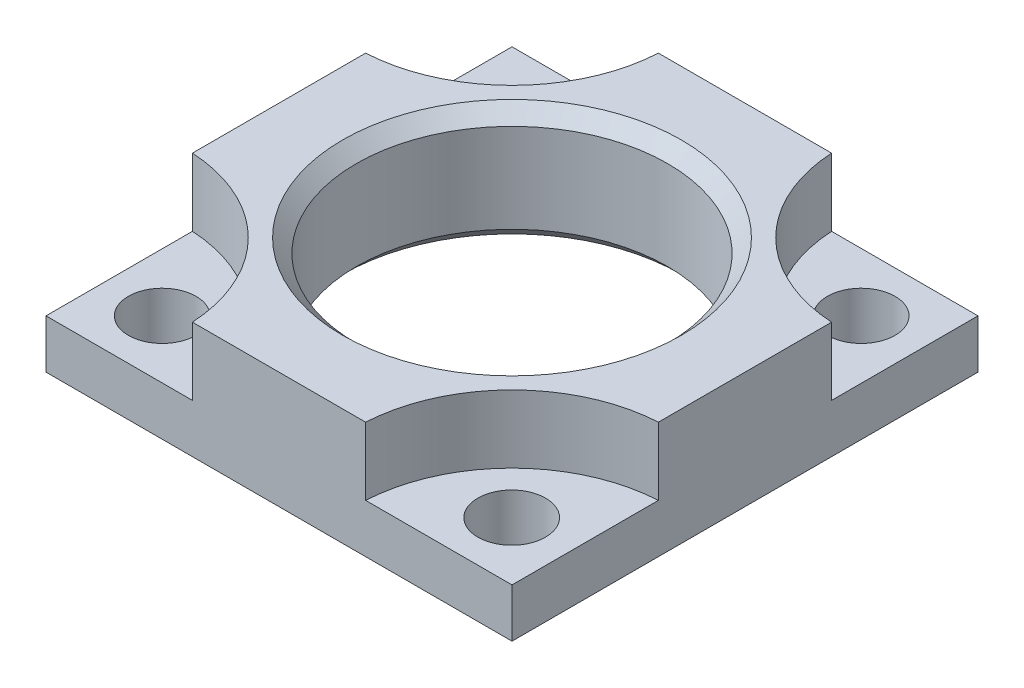
ISO-10303-21;
HEADER;
FILE_DESCRIPTION(('STEP AP214'),'2;1');
FILE_NAME('part.step','',(''),(''),'','','');
FILE_SCHEMA(('AUTOMOTIVE_DESIGN { 1 0 10303 214 1 1 1 1 }'));
ENDSEC;
DATA;
#1=APPLICATION_CONTEXT('core data for automotive mechanical design processes');
#2=APPLICATION_PROTOCOL_DEFINITION('international standard','automotive_design',2000,#1);
#3=PRODUCT_CONTEXT('',#1,'mechanical');
#4=PRODUCT('Part','Part','',(#3));
#5=PRODUCT_RELATED_PRODUCT_CATEGORY('part','',(#4));
#6=PRODUCT_DEFINITION_FORMATION('','',#4);
#7=PRODUCT_DEFINITION_CONTEXT('part definition',#1,'design');
#8=PRODUCT_DEFINITION('design','',#6,#7);
#9=PRODUCT_DEFINITION_SHAPE('','',#8);
#10=(LENGTH_UNIT() NAMED_UNIT(*) SI_UNIT(.MILLI.,.METRE.));
#11=(NAMED_UNIT(*) PLANE_ANGLE_UNIT() SI_UNIT($,.RADIAN.));
#12=(NAMED_UNIT(*) SI_UNIT($,.STERADIAN.) SOLID_ANGLE_UNIT());
#13=UNCERTAINTY_MEASURE_WITH_UNIT(LENGTH_MEASURE(1.E-05),#10,'distance_accuracy_value','');
#14=(GEOMETRIC_REPRESENTATION_CONTEXT(3) GLOBAL_UNCERTAINTY_ASSIGNED_CONTEXT((#13)) GLOBAL_UNIT_ASSIGNED_CONTEXT((#10,
#11,#12)) REPRESENTATION_CONTEXT('',''));
#15=CARTESIAN_POINT('',(0.,0.,0.));
#16=DIRECTION('',(0.,0.,1.));
#17=DIRECTION('',(1.,0.,0.));
#18=AXIS2_PLACEMENT_3D('',#15,#16,#17);
#19=CARTESIAN_POINT('',(0.,9.525,0.));
#20=DIRECTION('',(0.,-1.,0.));
#21=DIRECTION('',(0.,0.,-1.));
#22=AXIS2_PLACEMENT_3D('',#19,#20,#21);
#23=CYLINDRICAL_SURFACE('',#22,12.7254);
#24=CARTESIAN_POINT('',(0.,8.40739999999999,0.));
#25=DIRECTION('',(0.,-1.,0.));
#26=DIRECTION('',(0.,0.,-1.));
#27=AXIS2_PLACEMENT_3D('',#24,#25,#26);
#28=CIRCLE('',#27,12.7254);
#29=CARTESIAN_POINT('',(0.,8.40739999999999,-12.7254));
#30=VERTEX_POINT('',#29);
#31=EDGE_CURVE('E257',#30,#30,#28,.T.);
#32=ORIENTED_EDGE('',*,*,#31,.F.);
#33=EDGE_LOOP('',(#32));
#34=FACE_BOUND('',#33,.T.);
#35=CARTESIAN_POINT('',(0.,1.11760000000001,0.));
#36=DIRECTION('',(0.,-1.,0.));
#37=DIRECTION('',(0.,0.,-1.));
#38=AXIS2_PLACEMENT_3D('',#35,#36,#37);
#39=CIRCLE('',#38,12.7254);
#40=CARTESIAN_POINT('',(0.,1.11760000000001,-12.7254));
#41=VERTEX_POINT('',#40);
#42=EDGE_CURVE('E263',#41,#41,#39,.T.);
#43=ORIENTED_EDGE('',*,*,#42,.T.);
#44=EDGE_LOOP('',(#43));
#45=FACE_BOUND('',#44,.T.);
#46=ADVANCED_FACE('F33',(#34,#45),#23,.F.);
#47=CARTESIAN_POINT('',(-19.05,0.,19.05));
#48=DIRECTION('',(0.,1.,0.));
#49=DIRECTION('',(0.,0.,1.));
#50=AXIS2_PLACEMENT_3D('',#47,#48,#49);
#51=PLANE('',#50);
#52=DIRECTION('',(0.,0.,1.));
#53=VECTOR('',#52,1.);
#54=CARTESIAN_POINT('',(-19.05,0.,-19.05));
#55=LINE('',#54,#53);
#56=CARTESIAN_POINT('',(-19.05,0.,-19.05));
#57=VERTEX_POINT('',#56);
#58=CARTESIAN_POINT('',(-19.05,0.,19.05));
#59=VERTEX_POINT('',#58);
#60=EDGE_CURVE('E171',#57,#59,#55,.T.);
#61=ORIENTED_EDGE('',*,*,#60,.F.);
#62=DIRECTION('',(-1.,0.,0.));
#63=VECTOR('',#62,1.);
#64=CARTESIAN_POINT('',(-19.05,0.,-19.05));
#65=LINE('',#64,#63);
#66=CARTESIAN_POINT('',(19.05,0.,-19.05));
#67=VERTEX_POINT('',#66);
#68=EDGE_CURVE('E140',#67,#57,#65,.T.);
#69=ORIENTED_EDGE('',*,*,#68,.F.);
#70=DIRECTION('',(0.,0.,-1.));
#71=VECTOR('',#70,1.);
#72=CARTESIAN_POINT('',(19.05,0.,-19.05));
#73=LINE('',#72,#71);
#74=CARTESIAN_POINT('',(19.05,0.,19.05));
#75=VERTEX_POINT('',#74);
#76=EDGE_CURVE('E159',#75,#67,#73,.T.);
#77=ORIENTED_EDGE('',*,*,#76,.F.);
#78=DIRECTION('',(1.,0.,0.));
#79=VECTOR('',#78,1.);
#80=CARTESIAN_POINT('',(-19.05,0.,19.05));
#81=LINE('',#80,#79);
#82=EDGE_CURVE('E166',#59,#75,#81,.T.);
#83=ORIENTED_EDGE('',*,*,#82,.F.);
#84=EDGE_LOOP('',(#61,#69,#77,#83));
#85=FACE_BOUND('',#84,.T.);
#86=CARTESIAN_POINT('',(14.2748,0.,-14.2748));
#87=DIRECTION('',(0.,1.,0.));
#88=DIRECTION('',(0.,0.,1.));
#89=AXIS2_PLACEMENT_3D('',#86,#87,#88);
#90=CIRCLE('',#89,2.76860000000001);
#91=CARTESIAN_POINT('',(14.2748,0.,-11.5062));
#92=VERTEX_POINT('',#91);
#93=EDGE_CURVE('E228',#92,#92,#90,.T.);
#94=ORIENTED_EDGE('',*,*,#93,.T.);
#95=EDGE_LOOP('',(#94));
#96=FACE_BOUND('',#95,.T.);
#97=CARTESIAN_POINT('',(14.2748,0.,14.3002));
#98=DIRECTION('',(0.,1.,0.));
#99=DIRECTION('',(0.,0.,1.));
#100=AXIS2_PLACEMENT_3D('',#97,#98,#99);
#101=CIRCLE('',#100,2.76860000000001);
#102=CARTESIAN_POINT('',(14.2748,0.,17.0688));
#103=VERTEX_POINT('',#102);
#104=EDGE_CURVE('E236',#103,#103,#101,.T.);
#105=ORIENTED_EDGE('',*,*,#104,.T.);
#106=EDGE_LOOP('',(#105));
#107=FACE_BOUND('',#106,.T.);
#108=CARTESIAN_POINT('',(-14.3002,0.,-14.2748));
#109=DIRECTION('',(0.,1.,0.));
#110=DIRECTION('',(0.,0.,1.));
#111=AXIS2_PLACEMENT_3D('',#108,#109,#110);
#112=CIRCLE('',#111,2.76860000000001);
#113=CARTESIAN_POINT('',(-14.3002,0.,-11.5062));
#114=VERTEX_POINT('',#113);
#115=EDGE_CURVE('E242',#114,#114,#112,.T.);
#116=ORIENTED_EDGE('',*,*,#115,.T.);
#117=EDGE_LOOP('',(#116));
#118=FACE_BOUND('',#117,.T.);
#119=CARTESIAN_POINT('',(-14.3002,0.,14.3002));
#120=DIRECTION('',(0.,1.,0.));
#121=DIRECTION('',(0.,0.,1.));
#122=AXIS2_PLACEMENT_3D('',#119,#120,#121);
#123=CIRCLE('',#122,2.76860000000001);
#124=CARTESIAN_POINT('',(-14.3002,0.,17.0688));
#125=VERTEX_POINT('',#124);
#126=EDGE_CURVE('E248',#125,#125,#123,.T.);
#127=ORIENTED_EDGE('',*,*,#126,.T.);
#128=EDGE_LOOP('',(#127));
#129=FACE_BOUND('',#128,.T.);
#130=CARTESIAN_POINT('',(0.,0.,0.));
#131=DIRECTION('',(0.,-1.,0.));
#132=DIRECTION('',(0.,0.,-1.));
#133=AXIS2_PLACEMENT_3D('',#130,#131,#132);
#134=CIRCLE('',#133,13.843);
#135=CARTESIAN_POINT('',(0.,0.,-13.843));
#136=VERTEX_POINT('',#135);
#137=EDGE_CURVE('E260',#136,#136,#134,.T.);
#138=ORIENTED_EDGE('',*,*,#137,.F.);
#139=EDGE_LOOP('',(#138));
#140=FACE_BOUND('',#139,.T.);
#141=ADVANCED_FACE('F173',(#85,#96,#107,#118,#129,#140),#51,.F.);
#142=CARTESIAN_POINT('',(-19.05,9.525,19.05));
#143=DIRECTION('',(0.,1.,0.));
#144=DIRECTION('',(0.,0.,1.));
#145=AXIS2_PLACEMENT_3D('',#142,#143,#144);
#146=PLANE('',#145);
#147=CARTESIAN_POINT('',(-19.7612,9.525,-19.7612));
#148=DIRECTION('',(0.,1.,0.));
#149=DIRECTION('',(0.,0.,1.));
#150=AXIS2_PLACEMENT_3D('',#147,#148,#149);
#151=CIRCLE('',#150,12.7);
#152=CARTESIAN_POINT('',(-19.05,9.525,-7.08112923679051));
#153=VERTEX_POINT('',#152);
#154=CARTESIAN_POINT('',(-7.08112923679052,9.525,-19.05));
#155=VERTEX_POINT('',#154);
#156=EDGE_CURVE('E227',#153,#155,#151,.T.);
#157=ORIENTED_EDGE('',*,*,#156,.F.);
#158=DIRECTION('',(0.,0.,1.));
#159=VECTOR('',#158,1.);
#160=CARTESIAN_POINT('',(-19.05,9.525,-19.05));
#161=LINE('',#160,#159);
#162=CARTESIAN_POINT('',(-19.05,9.525,7.08112923679051));
#163=VERTEX_POINT('',#162);
#164=EDGE_CURVE('E175',#153,#163,#161,.T.);
#165=ORIENTED_EDGE('',*,*,#164,.T.);
#166=CARTESIAN_POINT('',(-19.7612,9.525,19.7612));
#167=DIRECTION('',(0.,1.,0.));
#168=DIRECTION('',(0.,0.,-1.));
#169=AXIS2_PLACEMENT_3D('',#166,#167,#168);
#170=CIRCLE('',#169,12.7);
#171=CARTESIAN_POINT('',(-7.08112923679052,9.525,19.05));
#172=VERTEX_POINT('',#171);
#173=EDGE_CURVE('E190',#172,#163,#170,.T.);
#174=ORIENTED_EDGE('',*,*,#173,.F.);
#175=DIRECTION('',(1.,0.,0.));
#176=VECTOR('',#175,1.);
#177=CARTESIAN_POINT('',(-19.05,9.525,19.05));
#178=LINE('',#177,#176);
#179=CARTESIAN_POINT('',(7.08112923679052,9.525,19.05));
#180=VERTEX_POINT('',#179);
#181=EDGE_CURVE('E181',#172,#180,#178,.T.);
#182=ORIENTED_EDGE('',*,*,#181,.T.);
#183=CARTESIAN_POINT('',(19.7612,9.525,19.7612));
#184=DIRECTION('',(0.,1.,0.));
#185=DIRECTION('',(0.,0.,1.));
#186=AXIS2_PLACEMENT_3D('',#183,#184,#185);
#187=CIRCLE('',#186,12.7);
#188=CARTESIAN_POINT('',(19.05,9.525,7.08112923679051));
#189=VERTEX_POINT('',#188);
#190=EDGE_CURVE('E206',#189,#180,#187,.T.);
#191=ORIENTED_EDGE('',*,*,#190,.F.);
#192=DIRECTION('',(0.,0.,-1.));
#193=VECTOR('',#192,1.);
#194=CARTESIAN_POINT('',(19.05,9.525,-19.05));
#195=LINE('',#194,#193);
#196=CARTESIAN_POINT('',(19.05,9.525,-7.08112923679051));
#197=VERTEX_POINT('',#196);
#198=EDGE_CURVE('E147',#189,#197,#195,.T.);
#199=ORIENTED_EDGE('',*,*,#198,.T.);
#200=CARTESIAN_POINT('',(19.7612,9.525,-19.7612));
#201=DIRECTION('',(0.,1.,0.));
#202=DIRECTION('',(0.,0.,-1.));
#203=AXIS2_PLACEMENT_3D('',#200,#201,#202);
#204=CIRCLE('',#203,12.7);
#205=CARTESIAN_POINT('',(7.08112923679052,9.525,-19.05));
#206=VERTEX_POINT('',#205);
#207=EDGE_CURVE('E218',#206,#197,#204,.T.);
#208=ORIENTED_EDGE('',*,*,#207,.F.);
#209=DIRECTION('',(-1.,0.,0.));
#210=VECTOR('',#209,1.);
#211=CARTESIAN_POINT('',(-19.05,9.525,-19.05));
#212=LINE('',#211,#210);
#213=EDGE_CURVE('E143',#206,#155,#212,.T.);
#214=ORIENTED_EDGE('',*,*,#213,.T.);
#215=EDGE_LOOP('',(#157,#165,#174,#182,#191,#199,#208,#214));
#216=FACE_BOUND('',#215,.T.);
#217=CARTESIAN_POINT('',(0.,9.525,0.));
#218=DIRECTION('',(0.,-1.,0.));
#219=DIRECTION('',(0.,0.,-1.));
#220=AXIS2_PLACEMENT_3D('',#217,#218,#219);
#221=CIRCLE('',#220,13.843);
#222=CARTESIAN_POINT('',(0.,9.525,-13.843));
#223=VERTEX_POINT('',#222);
#224=EDGE_CURVE('E254',#223,#223,#221,.T.);
#225=ORIENTED_EDGE('',*,*,#224,.T.);
#226=EDGE_LOOP('',(#225));
#227=FACE_BOUND('',#226,.T.);
#228=ADVANCED_FACE('F285',(#216,#227),#146,.T.);
#229=CARTESIAN_POINT('',(-19.7612,3.9878,19.7612));
#230=DIRECTION('',(0.,-1.,0.));
#231=DIRECTION('',(0.,0.,-1.));
#232=AXIS2_PLACEMENT_3D('',#229,#230,#231);
#233=PLANE('',#232);
#234=DIRECTION('',(1.,0.,0.));
#235=VECTOR('',#234,1.);
#236=CARTESIAN_POINT('',(-7.08112923679052,3.9878,19.05));
#237=LINE('',#236,#235);
#238=CARTESIAN_POINT('',(-19.05,3.9878,19.05));
#239=VERTEX_POINT('',#238);
#240=CARTESIAN_POINT('',(-7.08112923679052,3.9878,19.05));
#241=VERTEX_POINT('',#240);
#242=EDGE_CURVE('E193',#239,#241,#237,.T.);
#243=ORIENTED_EDGE('',*,*,#242,.T.);
#244=CARTESIAN_POINT('',(-19.7612,3.9878,19.7612));
#245=DIRECTION('',(0.,1.,0.));
#246=DIRECTION('',(0.,0.,-1.));
#247=AXIS2_PLACEMENT_3D('',#244,#245,#246);
#248=CIRCLE('',#247,12.7);
#249=CARTESIAN_POINT('',(-19.05,3.9878,7.08112923679051));
#250=VERTEX_POINT('',#249);
#251=EDGE_CURVE('E196',#241,#250,#248,.T.);
#252=ORIENTED_EDGE('',*,*,#251,.T.);
#253=DIRECTION('',(0.,0.,1.));
#254=VECTOR('',#253,1.);
#255=CARTESIAN_POINT('',(-19.05,3.9878,19.05));
#256=LINE('',#255,#254);
#257=EDGE_CURVE('E187',#250,#239,#256,.T.);
#258=ORIENTED_EDGE('',*,*,#257,.T.);
#259=EDGE_LOOP('',(#243,#252,#258));
#260=FACE_BOUND('',#259,.T.);
#261=CARTESIAN_POINT('',(-14.3002,3.9878,14.3002));
#262=DIRECTION('',(0.,1.,0.));
#263=DIRECTION('',(0.,0.,1.));
#264=AXIS2_PLACEMENT_3D('',#261,#262,#263);
#265=CIRCLE('',#264,2.76860000000002);
#266=CARTESIAN_POINT('',(-14.3002,3.9878,17.0688));
#267=VERTEX_POINT('',#266);
#268=EDGE_CURVE('E251',#267,#267,#265,.T.);
#269=ORIENTED_EDGE('',*,*,#268,.F.);
#270=EDGE_LOOP('',(#269));
#271=FACE_BOUND('',#270,.T.);
#272=ADVANCED_FACE('F293',(#260,#271),#233,.F.);
#273=CARTESIAN_POINT('',(19.7612,3.9878,-19.7612));
#274=DIRECTION('',(0.,-1.,0.));
#275=DIRECTION('',(0.,0.,-1.));
#276=AXIS2_PLACEMENT_3D('',#273,#274,#275);
#277=PLANE('',#276);
#278=DIRECTION('',(-1.,0.,0.));
#279=VECTOR('',#278,1.);
#280=CARTESIAN_POINT('',(7.08112923679052,3.9878,-19.05));
#281=LINE('',#280,#279);
#282=CARTESIAN_POINT('',(19.05,3.9878,-19.05));
#283=VERTEX_POINT('',#282);
#284=CARTESIAN_POINT('',(7.08112923679052,3.9878,-19.05));
#285=VERTEX_POINT('',#284);
#286=EDGE_CURVE('E220',#283,#285,#281,.T.);
#287=ORIENTED_EDGE('',*,*,#286,.T.);
#288=CARTESIAN_POINT('',(19.7612,3.9878,-19.7612));
#289=DIRECTION('',(0.,1.,0.));
#290=DIRECTION('',(0.,0.,-1.));
#291=AXIS2_PLACEMENT_3D('',#288,#289,#290);
#292=CIRCLE('',#291,12.7);
#293=CARTESIAN_POINT('',(19.05,3.9878,-7.08112923679051));
#294=VERTEX_POINT('',#293);
#295=EDGE_CURVE('E222',#285,#294,#292,.T.);
#296=ORIENTED_EDGE('',*,*,#295,.T.);
#297=DIRECTION('',(0.,0.,-1.));
#298=VECTOR('',#297,1.);
#299=CARTESIAN_POINT('',(19.05,3.9878,-19.05));
#300=LINE('',#299,#298);
#301=EDGE_CURVE('E56',#294,#283,#300,.T.);
#302=ORIENTED_EDGE('',*,*,#301,.T.);
#303=EDGE_LOOP('',(#287,#296,#302));
#304=FACE_BOUND('',#303,.T.);
#305=CARTESIAN_POINT('',(14.2748,3.9878,-14.2748));
#306=DIRECTION('',(0.,1.,0.));
#307=DIRECTION('',(0.,0.,1.));
#308=AXIS2_PLACEMENT_3D('',#305,#306,#307);
#309=CIRCLE('',#308,2.76860000000001);
#310=CARTESIAN_POINT('',(14.2748,3.9878,-11.5062));
#311=VERTEX_POINT('',#310);
#312=EDGE_CURVE('E233',#311,#311,#309,.T.);
#313=ORIENTED_EDGE('',*,*,#312,.F.);
#314=EDGE_LOOP('',(#313));
#315=FACE_BOUND('',#314,.T.);
#316=ADVANCED_FACE('F303',(#304,#315),#277,.F.);
#317=CARTESIAN_POINT('',(-19.05,9.525,-19.05));
#318=DIRECTION('',(1.,0.,0.));
#319=DIRECTION('',(0.,0.,-1.));
#320=AXIS2_PLACEMENT_3D('',#317,#318,#319);
#321=PLANE('',#320);
#322=ORIENTED_EDGE('',*,*,#164,.F.);
#323=DIRECTION('',(0.,1.,0.));
#324=VECTOR('',#323,1.);
#325=CARTESIAN_POINT('',(-19.05,3.9878,-7.08112923679051));
#326=LINE('',#325,#324);
#327=CARTESIAN_POINT('',(-19.05,3.9878,-7.08112923679051));
#328=VERTEX_POINT('',#327);
#329=EDGE_CURVE('E135',#328,#153,#326,.T.);
#330=ORIENTED_EDGE('',*,*,#329,.F.);
#331=DIRECTION('',(0.,0.,1.));
#332=VECTOR('',#331,1.);
#333=CARTESIAN_POINT('',(-19.05,3.9878,-19.05));
#334=LINE('',#333,#332);
#335=CARTESIAN_POINT('',(-19.05,3.9878,-19.05));
#336=VERTEX_POINT('',#335);
#337=EDGE_CURVE('E124',#336,#328,#334,.T.);
#338=ORIENTED_EDGE('',*,*,#337,.F.);
#339=DIRECTION('',(0.,-1.,0.));
#340=VECTOR('',#339,1.);
#341=CARTESIAN_POINT('',(-19.05,9.525,-19.05));
#342=LINE('',#341,#340);
#343=EDGE_CURVE('E133',#336,#57,#342,.T.);
#344=ORIENTED_EDGE('',*,*,#343,.T.);
#345=ORIENTED_EDGE('',*,*,#60,.T.);
#346=DIRECTION('',(0.,-1.,0.));
#347=VECTOR('',#346,1.);
#348=CARTESIAN_POINT('',(-19.05,9.525,19.05));
#349=LINE('',#348,#347);
#350=EDGE_CURVE('E11',#239,#59,#349,.T.);
#351=ORIENTED_EDGE('',*,*,#350,.F.);
#352=ORIENTED_EDGE('',*,*,#257,.F.);
#353=DIRECTION('',(0.,1.,0.));
#354=VECTOR('',#353,1.);
#355=CARTESIAN_POINT('',(-19.05,3.9878,7.08112923679051));
#356=LINE('',#355,#354);
#357=EDGE_CURVE('E177',#250,#163,#356,.T.);
#358=ORIENTED_EDGE('',*,*,#357,.T.);
#359=EDGE_LOOP('',(#322,#330,#338,#344,#345,#351,#352,#358));
#360=FACE_BOUND('',#359,.T.);
#361=ADVANCED_FACE('F35',(#360),#321,.F.);
#362=CARTESIAN_POINT('',(-19.05,9.525,19.05));
#363=DIRECTION('',(0.,0.,-1.));
#364=DIRECTION('',(-1.,0.,0.));
#365=AXIS2_PLACEMENT_3D('',#362,#363,#364);
#366=PLANE('',#365);
#367=DIRECTION('',(1.,0.,0.));
#368=VECTOR('',#367,1.);
#369=CARTESIAN_POINT('',(7.08112923679052,3.9878,19.05));
#370=LINE('',#369,#368);
#371=CARTESIAN_POINT('',(7.08112923679052,3.9878,19.05));
#372=VERTEX_POINT('',#371);
#373=CARTESIAN_POINT('',(19.05,3.9878,19.05));
#374=VERTEX_POINT('',#373);
#375=EDGE_CURVE('E203',#372,#374,#370,.T.);
#376=ORIENTED_EDGE('',*,*,#375,.F.);
#377=DIRECTION('',(0.,1.,0.));
#378=VECTOR('',#377,1.);
#379=CARTESIAN_POINT('',(7.08112923679052,3.9878,19.05));
#380=LINE('',#379,#378);
#381=EDGE_CURVE('E194',#372,#180,#380,.T.);
#382=ORIENTED_EDGE('',*,*,#381,.T.);
#383=ORIENTED_EDGE('',*,*,#181,.F.);
#384=DIRECTION('',(0.,1.,0.));
#385=VECTOR('',#384,1.);
#386=CARTESIAN_POINT('',(-7.08112923679052,3.9878,19.05));
#387=LINE('',#386,#385);
#388=EDGE_CURVE('E185',#241,#172,#387,.T.);
#389=ORIENTED_EDGE('',*,*,#388,.F.);
#390=ORIENTED_EDGE('',*,*,#242,.F.);
#391=ORIENTED_EDGE('',*,*,#350,.T.);
#392=ORIENTED_EDGE('',*,*,#82,.T.);
#393=DIRECTION('',(0.,-1.,0.));
#394=VECTOR('',#393,1.);
#395=CARTESIAN_POINT('',(19.05,9.525,19.05));
#396=LINE('',#395,#394);
#397=EDGE_CURVE('E41',#374,#75,#396,.T.);
#398=ORIENTED_EDGE('',*,*,#397,.F.);
#399=EDGE_LOOP('',(#376,#382,#383,#389,#390,#391,#392,#398));
#400=FACE_BOUND('',#399,.T.);
#401=ADVANCED_FACE('F167',(#400),#366,.F.);
#402=CARTESIAN_POINT('',(19.05,9.525,-19.05));
#403=DIRECTION('',(-1.,0.,0.));
#404=DIRECTION('',(0.,0.,1.));
#405=AXIS2_PLACEMENT_3D('',#402,#403,#404);
#406=PLANE('',#405);
#407=ORIENTED_EDGE('',*,*,#301,.F.);
#408=DIRECTION('',(0.,1.,0.));
#409=VECTOR('',#408,1.);
#410=CARTESIAN_POINT('',(19.05,3.9878,-7.08112923679051));
#411=LINE('',#410,#409);
#412=EDGE_CURVE('E208',#294,#197,#411,.T.);
#413=ORIENTED_EDGE('',*,*,#412,.T.);
#414=ORIENTED_EDGE('',*,*,#198,.F.);
#415=DIRECTION('',(0.,1.,0.));
#416=VECTOR('',#415,1.);
#417=CARTESIAN_POINT('',(19.05,3.9878,7.08112923679051));
#418=LINE('',#417,#416);
#419=CARTESIAN_POINT('',(19.05,3.9878,7.08112923679051));
#420=VERTEX_POINT('',#419);
#421=EDGE_CURVE('E201',#420,#189,#418,.T.);
#422=ORIENTED_EDGE('',*,*,#421,.F.);
#423=DIRECTION('',(0.,0.,-1.));
#424=VECTOR('',#423,1.);
#425=CARTESIAN_POINT('',(19.05,3.9878,19.05));
#426=LINE('',#425,#424);
#427=EDGE_CURVE('E162',#374,#420,#426,.T.);
#428=ORIENTED_EDGE('',*,*,#427,.F.);
#429=ORIENTED_EDGE('',*,*,#397,.T.);
#430=ORIENTED_EDGE('',*,*,#76,.T.);
#431=DIRECTION('',(0.,-1.,0.));
#432=VECTOR('',#431,1.);
#433=CARTESIAN_POINT('',(19.05,9.525,-19.05));
#434=LINE('',#433,#432);
#435=EDGE_CURVE('E142',#283,#67,#434,.T.);
#436=ORIENTED_EDGE('',*,*,#435,.F.);
#437=EDGE_LOOP('',(#407,#413,#414,#422,#428,#429,#430,#436));
#438=FACE_BOUND('',#437,.T.);
#439=ADVANCED_FACE('F156',(#438),#406,.F.);
#440=CARTESIAN_POINT('',(-19.05,9.525,-19.05));
#441=DIRECTION('',(0.,0.,1.));
#442=DIRECTION('',(1.,0.,0.));
#443=AXIS2_PLACEMENT_3D('',#440,#441,#442);
#444=PLANE('',#443);
#445=DIRECTION('',(-1.,0.,0.));
#446=VECTOR('',#445,1.);
#447=CARTESIAN_POINT('',(-7.08112923679052,3.9878,-19.05));
#448=LINE('',#447,#446);
#449=CARTESIAN_POINT('',(-7.08112923679051,3.9878,-19.05));
#450=VERTEX_POINT('',#449);
#451=EDGE_CURVE('E121',#450,#336,#448,.T.);
#452=ORIENTED_EDGE('',*,*,#451,.F.);
#453=DIRECTION('',(0.,1.,0.));
#454=VECTOR('',#453,1.);
#455=CARTESIAN_POINT('',(-7.08112923679052,3.9878,-19.05));
#456=LINE('',#455,#454);
#457=EDGE_CURVE('E136',#450,#155,#456,.T.);
#458=ORIENTED_EDGE('',*,*,#457,.T.);
#459=ORIENTED_EDGE('',*,*,#213,.F.);
#460=DIRECTION('',(0.,1.,0.));
#461=VECTOR('',#460,1.);
#462=CARTESIAN_POINT('',(7.08112923679052,3.9878,-19.05));
#463=LINE('',#462,#461);
#464=EDGE_CURVE('E214',#285,#206,#463,.T.);
#465=ORIENTED_EDGE('',*,*,#464,.F.);
#466=ORIENTED_EDGE('',*,*,#286,.F.);
#467=ORIENTED_EDGE('',*,*,#435,.T.);
#468=ORIENTED_EDGE('',*,*,#68,.T.);
#469=ORIENTED_EDGE('',*,*,#343,.F.);
#470=EDGE_LOOP('',(#452,#458,#459,#465,#466,#467,#468,#469));
#471=FACE_BOUND('',#470,.T.);
#472=ADVANCED_FACE('F138',(#471),#444,.F.);
#473=CARTESIAN_POINT('',(-19.7612,3.9878,19.7612));
#474=DIRECTION('',(0.,1.,0.));
#475=DIRECTION('',(0.,0.,1.));
#476=AXIS2_PLACEMENT_3D('',#473,#474,#475);
#477=CYLINDRICAL_SURFACE('',#476,12.7);
#478=ORIENTED_EDGE('',*,*,#173,.T.);
#479=ORIENTED_EDGE('',*,*,#357,.F.);
#480=ORIENTED_EDGE('',*,*,#251,.F.);
#481=ORIENTED_EDGE('',*,*,#388,.T.);
#482=EDGE_LOOP('',(#478,#479,#480,#481));
#483=FACE_BOUND('',#482,.T.);
#484=ADVANCED_FACE('F290',(#483),#477,.F.);
#485=CARTESIAN_POINT('',(19.7612,3.9878,19.7612));
#486=DIRECTION('',(0.,1.,0.));
#487=DIRECTION('',(0.,0.,1.));
#488=AXIS2_PLACEMENT_3D('',#485,#486,#487);
#489=CYLINDRICAL_SURFACE('',#488,12.7);
#490=ORIENTED_EDGE('',*,*,#190,.T.);
#491=ORIENTED_EDGE('',*,*,#381,.F.);
#492=CARTESIAN_POINT('',(19.7612,3.9878,19.7612));
#493=DIRECTION('',(0.,1.,0.));
#494=DIRECTION('',(0.,0.,1.));
#495=AXIS2_PLACEMENT_3D('',#492,#493,#494);
#496=CIRCLE('',#495,12.7);
#497=EDGE_CURVE('E210',#420,#372,#496,.T.);
#498=ORIENTED_EDGE('',*,*,#497,.F.);
#499=ORIENTED_EDGE('',*,*,#421,.T.);
#500=EDGE_LOOP('',(#490,#491,#498,#499));
#501=FACE_BOUND('',#500,.T.);
#502=ADVANCED_FACE('F324',(#501),#489,.F.);
#503=CARTESIAN_POINT('',(19.7612,3.9878,19.7612));
#504=DIRECTION('',(0.,1.,0.));
#505=DIRECTION('',(0.,0.,1.));
#506=AXIS2_PLACEMENT_3D('',#503,#504,#505);
#507=PLANE('',#506);
#508=CARTESIAN_POINT('',(14.2748,3.9878,14.3002));
#509=DIRECTION('',(0.,1.,0.));
#510=DIRECTION('',(0.,0.,1.));
#511=AXIS2_PLACEMENT_3D('',#508,#509,#510);
#512=CIRCLE('',#511,2.76860000000002);
#513=CARTESIAN_POINT('',(14.2748,3.9878,17.0688));
#514=VERTEX_POINT('',#513);
#515=EDGE_CURVE('E239',#514,#514,#512,.T.);
#516=ORIENTED_EDGE('',*,*,#515,.F.);
#517=EDGE_LOOP('',(#516));
#518=FACE_BOUND('',#517,.T.);
#519=ORIENTED_EDGE('',*,*,#427,.T.);
#520=ORIENTED_EDGE('',*,*,#497,.T.);
#521=ORIENTED_EDGE('',*,*,#375,.T.);
#522=EDGE_LOOP('',(#519,#520,#521));
#523=FACE_BOUND('',#522,.T.);
#524=ADVANCED_FACE('F320',(#518,#523),#507,.T.);
#525=CARTESIAN_POINT('',(19.7612,3.9878,-19.7612));
#526=DIRECTION('',(0.,1.,0.));
#527=DIRECTION('',(0.,0.,1.));
#528=AXIS2_PLACEMENT_3D('',#525,#526,#527);
#529=CYLINDRICAL_SURFACE('',#528,12.7);
#530=ORIENTED_EDGE('',*,*,#207,.T.);
#531=ORIENTED_EDGE('',*,*,#412,.F.);
#532=ORIENTED_EDGE('',*,*,#295,.F.);
#533=ORIENTED_EDGE('',*,*,#464,.T.);
#534=EDGE_LOOP('',(#530,#531,#532,#533));
#535=FACE_BOUND('',#534,.T.);
#536=ADVANCED_FACE('F317',(#535),#529,.F.);
#537=CARTESIAN_POINT('',(-19.7612,3.9878,-19.7612));
#538=DIRECTION('',(0.,1.,0.));
#539=DIRECTION('',(0.,0.,1.));
#540=AXIS2_PLACEMENT_3D('',#537,#538,#539);
#541=CYLINDRICAL_SURFACE('',#540,12.7);
#542=ORIENTED_EDGE('',*,*,#156,.T.);
#543=ORIENTED_EDGE('',*,*,#457,.F.);
#544=CARTESIAN_POINT('',(-19.7612,3.9878,-19.7612));
#545=DIRECTION('',(0.,1.,0.));
#546=DIRECTION('',(0.,0.,1.));
#547=AXIS2_PLACEMENT_3D('',#544,#545,#546);
#548=CIRCLE('',#547,12.7);
#549=EDGE_CURVE('E48',#328,#450,#548,.T.);
#550=ORIENTED_EDGE('',*,*,#549,.F.);
#551=ORIENTED_EDGE('',*,*,#329,.T.);
#552=EDGE_LOOP('',(#542,#543,#550,#551));
#553=FACE_BOUND('',#552,.T.);
#554=ADVANCED_FACE('F315',(#553),#541,.F.);
#555=CARTESIAN_POINT('',(-19.7612,3.9878,-19.7612));
#556=DIRECTION('',(0.,1.,0.));
#557=DIRECTION('',(0.,0.,1.));
#558=AXIS2_PLACEMENT_3D('',#555,#556,#557);
#559=PLANE('',#558);
#560=CARTESIAN_POINT('',(-14.3002,3.9878,-14.2748));
#561=DIRECTION('',(0.,1.,0.));
#562=DIRECTION('',(0.,0.,1.));
#563=AXIS2_PLACEMENT_3D('',#560,#561,#562);
#564=CIRCLE('',#563,2.76860000000002);
#565=CARTESIAN_POINT('',(-14.3002,3.9878,-11.5062));
#566=VERTEX_POINT('',#565);
#567=EDGE_CURVE('E245',#566,#566,#564,.T.);
#568=ORIENTED_EDGE('',*,*,#567,.F.);
#569=EDGE_LOOP('',(#568));
#570=FACE_BOUND('',#569,.T.);
#571=ORIENTED_EDGE('',*,*,#549,.T.);
#572=ORIENTED_EDGE('',*,*,#451,.T.);
#573=ORIENTED_EDGE('',*,*,#337,.T.);
#574=EDGE_LOOP('',(#571,#572,#573));
#575=FACE_BOUND('',#574,.T.);
#576=ADVANCED_FACE('F123',(#570,#575),#559,.T.);
#577=CARTESIAN_POINT('',(14.2748,3.9878,-14.2748));
#578=DIRECTION('',(0.,1.,0.));
#579=DIRECTION('',(0.,0.,1.));
#580=AXIS2_PLACEMENT_3D('',#577,#578,#579);
#581=CYLINDRICAL_SURFACE('',#580,2.76860000000001);
#582=ORIENTED_EDGE('',*,*,#93,.F.);
#583=EDGE_LOOP('',(#582));
#584=FACE_BOUND('',#583,.T.);
#585=ORIENTED_EDGE('',*,*,#312,.T.);
#586=EDGE_LOOP('',(#585));
#587=FACE_BOUND('',#586,.T.);
#588=ADVANCED_FACE('F357',(#584,#587),#581,.F.);
#589=CARTESIAN_POINT('',(14.2748,3.9878,14.3002));
#590=DIRECTION('',(0.,1.,0.));
#591=DIRECTION('',(0.,0.,1.));
#592=AXIS2_PLACEMENT_3D('',#589,#590,#591);
#593=CYLINDRICAL_SURFACE('',#592,2.76860000000001);
#594=ORIENTED_EDGE('',*,*,#104,.F.);
#595=EDGE_LOOP('',(#594));
#596=FACE_BOUND('',#595,.T.);
#597=ORIENTED_EDGE('',*,*,#515,.T.);
#598=EDGE_LOOP('',(#597));
#599=FACE_BOUND('',#598,.T.);
#600=ADVANCED_FACE('F350',(#596,#599),#593,.F.);
#601=CARTESIAN_POINT('',(-14.3002,3.9878,-14.2748));
#602=DIRECTION('',(0.,1.,0.));
#603=DIRECTION('',(0.,0.,1.));
#604=AXIS2_PLACEMENT_3D('',#601,#602,#603);
#605=CYLINDRICAL_SURFACE('',#604,2.76860000000001);
#606=ORIENTED_EDGE('',*,*,#115,.F.);
#607=EDGE_LOOP('',(#606));
#608=FACE_BOUND('',#607,.T.);
#609=ORIENTED_EDGE('',*,*,#567,.T.);
#610=EDGE_LOOP('',(#609));
#611=FACE_BOUND('',#610,.T.);
#612=ADVANCED_FACE('F344',(#608,#611),#605,.F.);
#613=CARTESIAN_POINT('',(-14.3002,3.9878,14.3002));
#614=DIRECTION('',(0.,1.,0.));
#615=DIRECTION('',(0.,0.,1.));
#616=AXIS2_PLACEMENT_3D('',#613,#614,#615);
#617=CYLINDRICAL_SURFACE('',#616,2.76860000000001);
#618=ORIENTED_EDGE('',*,*,#126,.F.);
#619=EDGE_LOOP('',(#618));
#620=FACE_BOUND('',#619,.T.);
#621=ORIENTED_EDGE('',*,*,#268,.T.);
#622=EDGE_LOOP('',(#621));
#623=FACE_BOUND('',#622,.T.);
#624=ADVANCED_FACE('F276',(#620,#623),#617,.F.);
#625=CARTESIAN_POINT('',(0.,9.525,0.));
#626=DIRECTION('',(0.,1.,0.));
#627=DIRECTION('',(0.,0.,1.));
#628=AXIS2_PLACEMENT_3D('',#625,#626,#627);
#629=CONICAL_SURFACE('',#628,13.843,0.785398163397443);
#630=ORIENTED_EDGE('',*,*,#31,.T.);
#631=EDGE_LOOP('',(#630));
#632=FACE_BOUND('',#631,.T.);
#633=ORIENTED_EDGE('',*,*,#224,.F.);
#634=EDGE_LOOP('',(#633));
#635=FACE_BOUND('',#634,.T.);
#636=ADVANCED_FACE('F270',(#632,#635),#629,.F.);
#637=CARTESIAN_POINT('',(0.,1.11760000000001,0.));
#638=DIRECTION('',(0.,-1.,0.));
#639=DIRECTION('',(0.,0.,-1.));
#640=AXIS2_PLACEMENT_3D('',#637,#638,#639);
#641=CONICAL_SURFACE('',#640,12.7254,0.785398163397443);
#642=ORIENTED_EDGE('',*,*,#137,.T.);
#643=EDGE_LOOP('',(#642));
#644=FACE_BOUND('',#643,.T.);
#645=ORIENTED_EDGE('',*,*,#42,.F.);
#646=EDGE_LOOP('',(#645));
#647=FACE_BOUND('',#646,.T.);
#648=ADVANCED_FACE('F268',(#644,#647),#641,.F.);
#649=CLOSED_SHELL('',(#46,#141,#228,#272,#316,#361,#401,#439,#472,#484,#502,#524,#536,#554,#576,
#588,#600,#612,#624,#636,#648));
#650=MANIFOLD_SOLID_BREP('B2',#649);
#651=ADVANCED_BREP_SHAPE_REPRESENTATION('',(#18,#650),#14);
#652=SHAPE_DEFINITION_REPRESENTATION(#9,#651);
ENDSEC;
END-ISO-10303-21;
